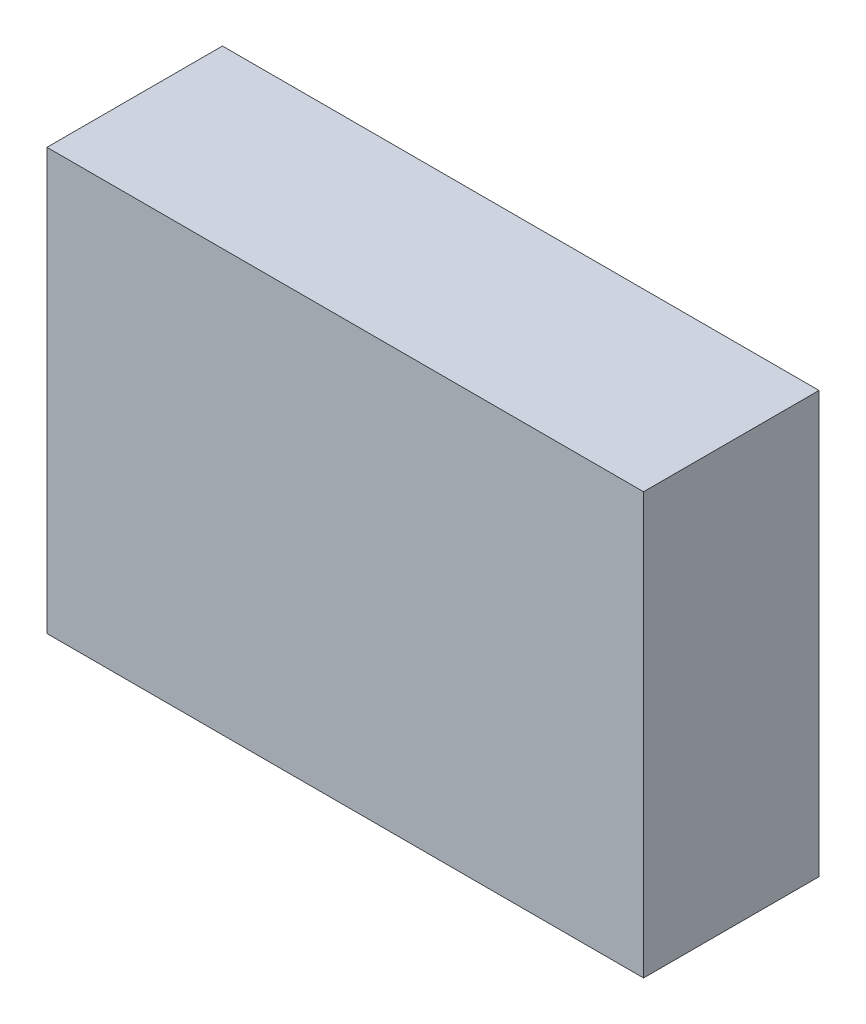
ISO-10303-21;
HEADER;
FILE_DESCRIPTION(('STEP AP214'),'2;1');
FILE_NAME('part.step','',(''),(''),'','','');
FILE_SCHEMA(('AUTOMOTIVE_DESIGN { 1 0 10303 214 1 1 1 1 }'));
ENDSEC;
DATA;
#1=APPLICATION_CONTEXT('core data for automotive mechanical design processes');
#2=APPLICATION_PROTOCOL_DEFINITION('international standard','automotive_design',2000,#1);
#3=PRODUCT_CONTEXT('',#1,'mechanical');
#4=PRODUCT('Part','Part','',(#3));
#5=PRODUCT_RELATED_PRODUCT_CATEGORY('part','',(#4));
#6=PRODUCT_DEFINITION_FORMATION('','',#4);
#7=PRODUCT_DEFINITION_CONTEXT('part definition',#1,'design');
#8=PRODUCT_DEFINITION('design','',#6,#7);
#9=PRODUCT_DEFINITION_SHAPE('','',#8);
#10=(LENGTH_UNIT() NAMED_UNIT(*) SI_UNIT(.MILLI.,.METRE.));
#11=(NAMED_UNIT(*) PLANE_ANGLE_UNIT() SI_UNIT($,.RADIAN.));
#12=(NAMED_UNIT(*) SI_UNIT($,.STERADIAN.) SOLID_ANGLE_UNIT());
#13=UNCERTAINTY_MEASURE_WITH_UNIT(LENGTH_MEASURE(1.E-05),#10,'distance_accuracy_value','');
#14=(GEOMETRIC_REPRESENTATION_CONTEXT(3) GLOBAL_UNCERTAINTY_ASSIGNED_CONTEXT((#13)) GLOBAL_UNIT_ASSIGNED_CONTEXT((#10,
#11,#12)) REPRESENTATION_CONTEXT('',''));
#15=CARTESIAN_POINT('',(0.,0.,0.));
#16=DIRECTION('',(0.,0.,1.));
#17=DIRECTION('',(1.,0.,0.));
#18=AXIS2_PLACEMENT_3D('',#15,#16,#17);
#19=CARTESIAN_POINT('',(2.58,-2.37,0.));
#20=DIRECTION('',(1.,0.,0.));
#21=DIRECTION('',(0.,0.,1.));
#22=AXIS2_PLACEMENT_3D('',#19,#20,#21);
#23=PLANE('',#22);
#24=DIRECTION('',(0.,1.,0.));
#25=VECTOR('',#24,1.);
#26=CARTESIAN_POINT('',(2.58,-2.37,0.1));
#27=LINE('',#26,#25);
#28=CARTESIAN_POINT('',(2.58,-2.37,0.1));
#29=VERTEX_POINT('',#28);
#30=CARTESIAN_POINT('',(2.58,-2.13,0.1));
#31=VERTEX_POINT('',#30);
#32=EDGE_CURVE('E11',#29,#31,#27,.T.);
#33=ORIENTED_EDGE('',*,*,#32,.T.);
#34=DIRECTION('',(0.,0.,1.));
#35=VECTOR('',#34,1.);
#36=CARTESIAN_POINT('',(2.58,-2.13,0.));
#37=LINE('',#36,#35);
#38=CARTESIAN_POINT('',(2.58,-2.13,0.));
#39=VERTEX_POINT('',#38);
#40=EDGE_CURVE('E24',#39,#31,#37,.T.);
#41=ORIENTED_EDGE('',*,*,#40,.F.);
#42=DIRECTION('',(0.,1.,0.));
#43=VECTOR('',#42,1.);
#44=CARTESIAN_POINT('',(2.58,-2.37,0.));
#45=LINE('',#44,#43);
#46=CARTESIAN_POINT('',(2.58,-2.37,0.));
#47=VERTEX_POINT('',#46);
#48=EDGE_CURVE('E86',#47,#39,#45,.T.);
#49=ORIENTED_EDGE('',*,*,#48,.F.);
#50=DIRECTION('',(0.,0.,1.));
#51=VECTOR('',#50,1.);
#52=CARTESIAN_POINT('',(2.58,-2.37,0.));
#53=LINE('',#52,#51);
#54=EDGE_CURVE('E36',#47,#29,#53,.T.);
#55=ORIENTED_EDGE('',*,*,#54,.T.);
#56=EDGE_LOOP('',(#33,#41,#49,#55));
#57=FACE_BOUND('',#56,.T.);
#58=ADVANCED_FACE('F17',(#57),#23,.F.);
#59=CARTESIAN_POINT('',(2.92,-2.37,0.));
#60=DIRECTION('',(1.,0.,0.));
#61=DIRECTION('',(0.,0.,1.));
#62=AXIS2_PLACEMENT_3D('',#59,#60,#61);
#63=PLANE('',#62);
#64=DIRECTION('',(0.,0.,1.));
#65=VECTOR('',#64,1.);
#66=CARTESIAN_POINT('',(2.92,-2.37,0.));
#67=LINE('',#66,#65);
#68=CARTESIAN_POINT('',(2.92,-2.37,0.));
#69=VERTEX_POINT('',#68);
#70=CARTESIAN_POINT('',(2.92,-2.37,0.1));
#71=VERTEX_POINT('',#70);
#72=EDGE_CURVE('E83',#69,#71,#67,.T.);
#73=ORIENTED_EDGE('',*,*,#72,.F.);
#74=DIRECTION('',(0.,1.,0.));
#75=VECTOR('',#74,1.);
#76=CARTESIAN_POINT('',(2.92,-2.37,0.));
#77=LINE('',#76,#75);
#78=CARTESIAN_POINT('',(2.92,-2.13,0.));
#79=VERTEX_POINT('',#78);
#80=EDGE_CURVE('E63',#69,#79,#77,.T.);
#81=ORIENTED_EDGE('',*,*,#80,.T.);
#82=DIRECTION('',(0.,0.,1.));
#83=VECTOR('',#82,1.);
#84=CARTESIAN_POINT('',(2.92,-2.13,0.));
#85=LINE('',#84,#83);
#86=CARTESIAN_POINT('',(2.92,-2.13,0.1));
#87=VERTEX_POINT('',#86);
#88=EDGE_CURVE('E57',#79,#87,#85,.T.);
#89=ORIENTED_EDGE('',*,*,#88,.T.);
#90=DIRECTION('',(0.,1.,0.));
#91=VECTOR('',#90,1.);
#92=CARTESIAN_POINT('',(2.92,-2.37,0.1));
#93=LINE('',#92,#91);
#94=EDGE_CURVE('E60',#71,#87,#93,.T.);
#95=ORIENTED_EDGE('',*,*,#94,.F.);
#96=EDGE_LOOP('',(#73,#81,#89,#95));
#97=FACE_BOUND('',#96,.T.);
#98=ADVANCED_FACE('F59',(#97),#63,.T.);
#99=CARTESIAN_POINT('',(2.58,-2.37,0.));
#100=DIRECTION('',(0.,1.,0.));
#101=DIRECTION('',(0.,0.,1.));
#102=AXIS2_PLACEMENT_3D('',#99,#100,#101);
#103=PLANE('',#102);
#104=ORIENTED_EDGE('',*,*,#72,.T.);
#105=DIRECTION('',(1.,0.,0.));
#106=VECTOR('',#105,1.);
#107=CARTESIAN_POINT('',(2.58,-2.37,0.1));
#108=LINE('',#107,#106);
#109=EDGE_CURVE('E71',#29,#71,#108,.T.);
#110=ORIENTED_EDGE('',*,*,#109,.F.);
#111=ORIENTED_EDGE('',*,*,#54,.F.);
#112=DIRECTION('',(1.,0.,0.));
#113=VECTOR('',#112,1.);
#114=CARTESIAN_POINT('',(2.58,-2.37,0.));
#115=LINE('',#114,#113);
#116=EDGE_CURVE('E76',#47,#69,#115,.T.);
#117=ORIENTED_EDGE('',*,*,#116,.T.);
#118=EDGE_LOOP('',(#104,#110,#111,#117));
#119=FACE_BOUND('',#118,.T.);
#120=ADVANCED_FACE('F91',(#119),#103,.F.);
#121=CARTESIAN_POINT('',(2.58,-2.13,0.));
#122=DIRECTION('',(0.,1.,0.));
#123=DIRECTION('',(0.,0.,1.));
#124=AXIS2_PLACEMENT_3D('',#121,#122,#123);
#125=PLANE('',#124);
#126=DIRECTION('',(1.,0.,0.));
#127=VECTOR('',#126,1.);
#128=CARTESIAN_POINT('',(2.58,-2.13,0.));
#129=LINE('',#128,#127);
#130=EDGE_CURVE('E74',#39,#79,#129,.T.);
#131=ORIENTED_EDGE('',*,*,#130,.F.);
#132=ORIENTED_EDGE('',*,*,#40,.T.);
#133=DIRECTION('',(1.,0.,0.));
#134=VECTOR('',#133,1.);
#135=CARTESIAN_POINT('',(2.58,-2.13,0.1));
#136=LINE('',#135,#134);
#137=EDGE_CURVE('E69',#31,#87,#136,.T.);
#138=ORIENTED_EDGE('',*,*,#137,.T.);
#139=ORIENTED_EDGE('',*,*,#88,.F.);
#140=EDGE_LOOP('',(#131,#132,#138,#139));
#141=FACE_BOUND('',#140,.T.);
#142=ADVANCED_FACE('F73',(#141),#125,.T.);
#143=CARTESIAN_POINT('',(2.58,-2.37,0.));
#144=DIRECTION('',(0.,0.,1.));
#145=DIRECTION('',(1.,0.,0.));
#146=AXIS2_PLACEMENT_3D('',#143,#144,#145);
#147=PLANE('',#146);
#148=ORIENTED_EDGE('',*,*,#130,.T.);
#149=ORIENTED_EDGE('',*,*,#80,.F.);
#150=ORIENTED_EDGE('',*,*,#116,.F.);
#151=ORIENTED_EDGE('',*,*,#48,.T.);
#152=EDGE_LOOP('',(#148,#149,#150,#151));
#153=FACE_BOUND('',#152,.T.);
#154=ADVANCED_FACE('F89',(#153),#147,.F.);
#155=CARTESIAN_POINT('',(2.58,-2.37,0.1));
#156=DIRECTION('',(0.,0.,1.));
#157=DIRECTION('',(1.,0.,0.));
#158=AXIS2_PLACEMENT_3D('',#155,#156,#157);
#159=PLANE('',#158);
#160=ORIENTED_EDGE('',*,*,#32,.F.);
#161=ORIENTED_EDGE('',*,*,#109,.T.);
#162=ORIENTED_EDGE('',*,*,#94,.T.);
#163=ORIENTED_EDGE('',*,*,#137,.F.);
#164=EDGE_LOOP('',(#160,#161,#162,#163));
#165=FACE_BOUND('',#164,.T.);
#166=ADVANCED_FACE('F68',(#165),#159,.T.);
#167=CLOSED_SHELL('',(#58,#98,#120,#142,#154,#166));
#168=MANIFOLD_SOLID_BREP('B1',#167);
#169=ADVANCED_BREP_SHAPE_REPRESENTATION('',(#18,#168),#14);
#170=SHAPE_DEFINITION_REPRESENTATION(#9,#169);
ENDSEC;
END-ISO-10303-21;
